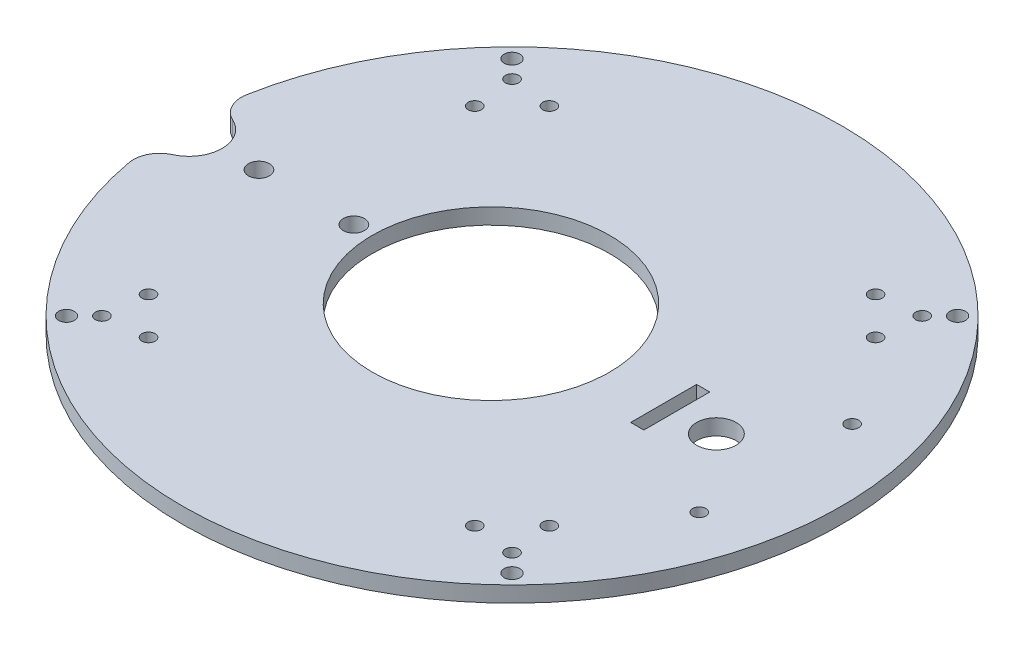
ISO-10303-21;
HEADER;
FILE_DESCRIPTION(('STEP AP214'),'2;1');
FILE_NAME('part.step','',(''),(''),'','','');
FILE_SCHEMA(('AUTOMOTIVE_DESIGN { 1 0 10303 214 1 1 1 1 }'));
ENDSEC;
DATA;
#1=APPLICATION_CONTEXT('core data for automotive mechanical design processes');
#2=APPLICATION_PROTOCOL_DEFINITION('international standard','automotive_design',2000,#1);
#3=PRODUCT_CONTEXT('',#1,'mechanical');
#4=PRODUCT('Part','Part','',(#3));
#5=PRODUCT_RELATED_PRODUCT_CATEGORY('part','',(#4));
#6=PRODUCT_DEFINITION_FORMATION('','',#4);
#7=PRODUCT_DEFINITION_CONTEXT('part definition',#1,'design');
#8=PRODUCT_DEFINITION('design','',#6,#7);
#9=PRODUCT_DEFINITION_SHAPE('','',#8);
#10=(LENGTH_UNIT() NAMED_UNIT(*) SI_UNIT(.MILLI.,.METRE.));
#11=(NAMED_UNIT(*) PLANE_ANGLE_UNIT() SI_UNIT($,.RADIAN.));
#12=(NAMED_UNIT(*) SI_UNIT($,.STERADIAN.) SOLID_ANGLE_UNIT());
#13=UNCERTAINTY_MEASURE_WITH_UNIT(LENGTH_MEASURE(1.E-05),#10,'distance_accuracy_value','');
#14=(GEOMETRIC_REPRESENTATION_CONTEXT(3) GLOBAL_UNCERTAINTY_ASSIGNED_CONTEXT((#13)) GLOBAL_UNIT_ASSIGNED_CONTEXT((#10,
#11,#12)) REPRESENTATION_CONTEXT('',''));
#15=CARTESIAN_POINT('',(0.,0.,0.));
#16=DIRECTION('',(0.,0.,1.));
#17=DIRECTION('',(1.,0.,0.));
#18=AXIS2_PLACEMENT_3D('',#15,#16,#17);
#19=CARTESIAN_POINT('',(0.,6.,0.));
#20=DIRECTION('',(0.,1.,0.));
#21=DIRECTION('',(0.,0.,1.));
#22=AXIS2_PLACEMENT_3D('',#19,#20,#21);
#23=PLANE('',#22);
#24=CARTESIAN_POINT('',(-84.4992603518605,6.,-84.499260351734));
#25=DIRECTION('',(0.,1.,0.));
#26=DIRECTION('',(0.,0.,1.));
#27=AXIS2_PLACEMENT_3D('',#24,#25,#26);
#28=CIRCLE('',#27,3.);
#29=CARTESIAN_POINT('',(-84.4992603518605,6.,-81.499260351734));
#30=VERTEX_POINT('',#29);
#31=EDGE_CURVE('E214',#30,#30,#28,.F.);
#32=ORIENTED_EDGE('',*,*,#31,.T.);
#33=EDGE_LOOP('',(#32));
#34=FACE_BOUND('',#33,.T.);
#35=CARTESIAN_POINT('',(-61.8718433538909,6.,-76.0139789774956));
#36=DIRECTION('',(0.,1.,0.));
#37=DIRECTION('',(0.,0.,1.));
#38=AXIS2_PLACEMENT_3D('',#35,#36,#37);
#39=CIRCLE('',#38,2.49999999999999);
#40=CARTESIAN_POINT('',(-61.8718433538909,6.,-73.5139789774956));
#41=VERTEX_POINT('',#40);
#42=EDGE_CURVE('E211',#41,#41,#39,.F.);
#43=ORIENTED_EDGE('',*,*,#42,.T.);
#44=EDGE_LOOP('',(#43));
#45=FACE_BOUND('',#44,.T.);
#46=CARTESIAN_POINT('',(-76.0139789776217,6.,-61.8718433537646));
#47=DIRECTION('',(0.,1.,0.));
#48=DIRECTION('',(0.,0.,1.));
#49=AXIS2_PLACEMENT_3D('',#46,#47,#48);
#50=CIRCLE('',#49,2.49999999999999);
#51=CARTESIAN_POINT('',(-76.0139789776217,6.,-59.3718433537646));
#52=VERTEX_POINT('',#51);
#53=EDGE_CURVE('E208',#52,#52,#50,.F.);
#54=ORIENTED_EDGE('',*,*,#53,.T.);
#55=EDGE_LOOP('',(#54));
#56=FACE_BOUND('',#55,.T.);
#57=CARTESIAN_POINT('',(-84.4992603517337,6.,84.4992603518608));
#58=DIRECTION('',(0.,1.,0.));
#59=DIRECTION('',(0.,0.,1.));
#60=AXIS2_PLACEMENT_3D('',#57,#58,#59);
#61=CIRCLE('',#60,2.99999999999999);
#62=CARTESIAN_POINT('',(-84.4992603517337,6.,87.4992603518607));
#63=VERTEX_POINT('',#62);
#64=EDGE_CURVE('E205',#63,#63,#61,.F.);
#65=ORIENTED_EDGE('',*,*,#64,.T.);
#66=EDGE_LOOP('',(#65));
#67=FACE_BOUND('',#66,.T.);
#68=CARTESIAN_POINT('',(-76.0139789774954,6.,61.8718433538912));
#69=DIRECTION('',(0.,1.,0.));
#70=DIRECTION('',(0.,0.,1.));
#71=AXIS2_PLACEMENT_3D('',#68,#69,#70);
#72=CIRCLE('',#71,2.5);
#73=CARTESIAN_POINT('',(-76.0139789774954,6.,64.3718433538912));
#74=VERTEX_POINT('',#73);
#75=EDGE_CURVE('E202',#74,#74,#72,.F.);
#76=ORIENTED_EDGE('',*,*,#75,.T.);
#77=EDGE_LOOP('',(#76));
#78=FACE_BOUND('',#77,.T.);
#79=CARTESIAN_POINT('',(-61.8718433537643,6.,76.0139789776219));
#80=DIRECTION('',(0.,1.,0.));
#81=DIRECTION('',(0.,0.,1.));
#82=AXIS2_PLACEMENT_3D('',#79,#80,#81);
#83=CIRCLE('',#82,2.50000000000001);
#84=CARTESIAN_POINT('',(-61.8718433537643,6.,78.513978977622));
#85=VERTEX_POINT('',#84);
#86=EDGE_CURVE('E199',#85,#85,#83,.F.);
#87=ORIENTED_EDGE('',*,*,#86,.T.);
#88=EDGE_LOOP('',(#87));
#89=FACE_BOUND('',#88,.T.);
#90=CARTESIAN_POINT('',(84.4992603518611,6.,84.4992603517334));
#91=DIRECTION('',(0.,1.,0.));
#92=DIRECTION('',(0.,0.,1.));
#93=AXIS2_PLACEMENT_3D('',#90,#91,#92);
#94=CIRCLE('',#93,2.99999999999999);
#95=CARTESIAN_POINT('',(84.4992603518611,6.,87.4992603517334));
#96=VERTEX_POINT('',#95);
#97=EDGE_CURVE('E196',#96,#96,#94,.F.);
#98=ORIENTED_EDGE('',*,*,#97,.T.);
#99=EDGE_LOOP('',(#98));
#100=FACE_BOUND('',#99,.T.);
#101=CARTESIAN_POINT('',(61.8718433538914,6.,76.0139789774952));
#102=DIRECTION('',(0.,1.,0.));
#103=DIRECTION('',(0.,0.,1.));
#104=AXIS2_PLACEMENT_3D('',#101,#102,#103);
#105=CIRCLE('',#104,2.5);
#106=CARTESIAN_POINT('',(61.8718433538914,6.,78.5139789774952));
#107=VERTEX_POINT('',#106);
#108=EDGE_CURVE('E193',#107,#107,#105,.F.);
#109=ORIENTED_EDGE('',*,*,#108,.T.);
#110=EDGE_LOOP('',(#109));
#111=FACE_BOUND('',#110,.T.);
#112=CARTESIAN_POINT('',(61.8718433537648,6.,-76.0139789776215));
#113=DIRECTION('',(0.,1.,0.));
#114=DIRECTION('',(0.,0.,1.));
#115=AXIS2_PLACEMENT_3D('',#112,#113,#114);
#116=CIRCLE('',#115,2.5);
#117=CARTESIAN_POINT('',(61.8718433537648,6.,-73.5139789776215));
#118=VERTEX_POINT('',#117);
#119=EDGE_CURVE('E190',#118,#118,#116,.F.);
#120=ORIENTED_EDGE('',*,*,#119,.T.);
#121=EDGE_LOOP('',(#120));
#122=FACE_BOUND('',#121,.T.);
#123=CARTESIAN_POINT('',(76.0139789774958,6.,-61.8718433538906));
#124=DIRECTION('',(0.,1.,0.));
#125=DIRECTION('',(0.,0.,1.));
#126=AXIS2_PLACEMENT_3D('',#123,#124,#125);
#127=CIRCLE('',#126,2.5);
#128=CARTESIAN_POINT('',(76.0139789774958,6.,-59.3718433538906));
#129=VERTEX_POINT('',#128);
#130=EDGE_CURVE('E187',#129,#129,#127,.F.);
#131=ORIENTED_EDGE('',*,*,#130,.T.);
#132=EDGE_LOOP('',(#131));
#133=FACE_BOUND('',#132,.T.);
#134=CARTESIAN_POINT('',(84.4992603517343,6.,-84.4992603518602));
#135=DIRECTION('',(0.,1.,0.));
#136=DIRECTION('',(0.,0.,1.));
#137=AXIS2_PLACEMENT_3D('',#134,#135,#136);
#138=CIRCLE('',#137,3.);
#139=CARTESIAN_POINT('',(84.4992603517343,6.,-81.4992603518602));
#140=VERTEX_POINT('',#139);
#141=EDGE_CURVE('E184',#140,#140,#138,.F.);
#142=ORIENTED_EDGE('',*,*,#141,.T.);
#143=EDGE_LOOP('',(#142));
#144=FACE_BOUND('',#143,.T.);
#145=CARTESIAN_POINT('',(76.0139789776222,6.,61.871843353764));
#146=DIRECTION('',(0.,1.,0.));
#147=DIRECTION('',(0.,0.,1.));
#148=AXIS2_PLACEMENT_3D('',#145,#146,#147);
#149=CIRCLE('',#148,2.49999999999999);
#150=CARTESIAN_POINT('',(76.0139789776222,6.,64.371843353764));
#151=VERTEX_POINT('',#150);
#152=EDGE_CURVE('E181',#151,#151,#149,.F.);
#153=ORIENTED_EDGE('',*,*,#152,.T.);
#154=EDGE_LOOP('',(#153));
#155=FACE_BOUND('',#154,.T.);
#156=CARTESIAN_POINT('',(77.5,6.,0.));
#157=DIRECTION('',(0.,1.,0.));
#158=DIRECTION('',(0.,0.,1.));
#159=AXIS2_PLACEMENT_3D('',#156,#157,#158);
#160=CIRCLE('',#159,7.5);
#161=CARTESIAN_POINT('',(77.5,6.,7.5));
#162=VERTEX_POINT('',#161);
#163=EDGE_CURVE('E218',#162,#162,#160,.T.);
#164=ORIENTED_EDGE('',*,*,#163,.F.);
#165=EDGE_LOOP('',(#164));
#166=FACE_BOUND('',#165,.T.);
#167=CARTESIAN_POINT('',(100.,6.,-29.));
#168=DIRECTION('',(0.,1.,0.));
#169=DIRECTION('',(0.,0.,1.));
#170=AXIS2_PLACEMENT_3D('',#167,#168,#169);
#171=CIRCLE('',#170,2.50000000000001);
#172=CARTESIAN_POINT('',(100.,6.,-26.5));
#173=VERTEX_POINT('',#172);
#174=EDGE_CURVE('E225',#173,#173,#171,.T.);
#175=ORIENTED_EDGE('',*,*,#174,.F.);
#176=EDGE_LOOP('',(#175));
#177=FACE_BOUND('',#176,.T.);
#178=CARTESIAN_POINT('',(100.,6.,29.));
#179=DIRECTION('',(0.,1.,0.));
#180=DIRECTION('',(0.,0.,-1.));
#181=AXIS2_PLACEMENT_3D('',#178,#179,#180);
#182=CIRCLE('',#181,2.50000000000001);
#183=CARTESIAN_POINT('',(100.,6.,26.5));
#184=VERTEX_POINT('',#183);
#185=EDGE_CURVE('E221',#184,#184,#182,.T.);
#186=ORIENTED_EDGE('',*,*,#185,.F.);
#187=EDGE_LOOP('',(#186));
#188=FACE_BOUND('',#187,.T.);
#189=CARTESIAN_POINT('',(-8.,6.,0.));
#190=DIRECTION('',(0.,1.,0.));
#191=DIRECTION('',(0.,0.,1.));
#192=AXIS2_PLACEMENT_3D('',#189,#190,#191);
#193=CIRCLE('',#192,45.);
#194=CARTESIAN_POINT('',(-8.,6.,45.));
#195=VERTEX_POINT('',#194);
#196=EDGE_CURVE('E239',#195,#195,#193,.F.);
#197=ORIENTED_EDGE('',*,*,#196,.T.);
#198=EDGE_LOOP('',(#197));
#199=FACE_BOUND('',#198,.T.);
#200=CARTESIAN_POINT('',(-77.7817459305157,6.,77.7817459305204));
#201=DIRECTION('',(0.,1.,0.));
#202=DIRECTION('',(0.,0.,1.));
#203=AXIS2_PLACEMENT_3D('',#200,#201,#202);
#204=CIRCLE('',#203,2.50000000000501);
#205=CARTESIAN_POINT('',(-77.7817459305157,6.,80.2817459305254));
#206=VERTEX_POINT('',#205);
#207=EDGE_CURVE('E242',#206,#206,#204,.T.);
#208=ORIENTED_EDGE('',*,*,#207,.F.);
#209=EDGE_LOOP('',(#208));
#210=FACE_BOUND('',#209,.T.);
#211=CARTESIAN_POINT('',(77.7817459305248,6.,77.7817459305157));
#212=DIRECTION('',(0.,1.,0.));
#213=DIRECTION('',(0.,0.,1.));
#214=AXIS2_PLACEMENT_3D('',#211,#212,#213);
#215=CIRCLE('',#214,2.50000000000671);
#216=CARTESIAN_POINT('',(77.7817459305248,6.,80.2817459305224));
#217=VERTEX_POINT('',#216);
#218=EDGE_CURVE('E253',#217,#217,#215,.T.);
#219=ORIENTED_EDGE('',*,*,#218,.F.);
#220=EDGE_LOOP('',(#219));
#221=FACE_BOUND('',#220,.T.);
#222=CARTESIAN_POINT('',(77.7817459305201,6.,-77.7817459305247));
#223=DIRECTION('',(0.,1.,0.));
#224=DIRECTION('',(0.,0.,1.));
#225=AXIS2_PLACEMENT_3D('',#222,#223,#224);
#226=CIRCLE('',#225,2.50000000000242);
#227=CARTESIAN_POINT('',(77.7817459305201,6.,-75.2817459305223));
#228=VERTEX_POINT('',#227);
#229=EDGE_CURVE('E247',#228,#228,#226,.T.);
#230=ORIENTED_EDGE('',*,*,#229,.F.);
#231=EDGE_LOOP('',(#230));
#232=FACE_BOUND('',#231,.T.);
#233=CARTESIAN_POINT('',(-77.7817459305204,6.,-77.7817459305201));
#234=DIRECTION('',(0.,1.,0.));
#235=DIRECTION('',(0.,0.,1.));
#236=AXIS2_PLACEMENT_3D('',#233,#234,#235);
#237=CIRCLE('',#236,2.5);
#238=CARTESIAN_POINT('',(-77.7817459305204,6.,-75.2817459305201));
#239=VERTEX_POINT('',#238);
#240=EDGE_CURVE('E261',#239,#239,#237,.T.);
#241=ORIENTED_EDGE('',*,*,#240,.F.);
#242=EDGE_LOOP('',(#241));
#243=FACE_BOUND('',#242,.T.);
#244=CARTESIAN_POINT('',(-96.,6.,0.));
#245=DIRECTION('',(0.,1.,0.));
#246=DIRECTION('',(0.,0.,1.));
#247=AXIS2_PLACEMENT_3D('',#244,#245,#246);
#248=CIRCLE('',#247,4.00000000000001);
#249=CARTESIAN_POINT('',(-96.,6.,4.00000000000001));
#250=VERTEX_POINT('',#249);
#251=EDGE_CURVE('E273',#250,#250,#248,.T.);
#252=ORIENTED_EDGE('',*,*,#251,.F.);
#253=EDGE_LOOP('',(#252));
#254=FACE_BOUND('',#253,.T.);
#255=CARTESIAN_POINT('',(-60.,6.,0.));
#256=DIRECTION('',(0.,1.,0.));
#257=DIRECTION('',(0.,0.,1.));
#258=AXIS2_PLACEMENT_3D('',#255,#256,#257);
#259=CIRCLE('',#258,4.00000000000001);
#260=CARTESIAN_POINT('',(-60.,6.,4.00000000000001));
#261=VERTEX_POINT('',#260);
#262=EDGE_CURVE('E267',#261,#261,#259,.T.);
#263=ORIENTED_EDGE('',*,*,#262,.F.);
#264=EDGE_LOOP('',(#263));
#265=FACE_BOUND('',#264,.T.);
#266=CARTESIAN_POINT('',(-122.5,6.,0.));
#267=DIRECTION('',(0.,1.,0.));
#268=DIRECTION('',(0.,0.,1.));
#269=AXIS2_PLACEMENT_3D('',#266,#267,#268);
#270=CIRCLE('',#269,12.5);
#271=CARTESIAN_POINT('',(-110.,6.,0.));
#272=VERTEX_POINT('',#271);
#273=CARTESIAN_POINT('',(-117.312925170068,6.,11.3729615627894));
#274=VERTEX_POINT('',#273);
#275=EDGE_CURVE('E286',#272,#274,#270,.F.);
#276=ORIENTED_EDGE('',*,*,#275,.T.);
#277=CARTESIAN_POINT('',(-113.163265306122,6.,20.471330813021));
#278=DIRECTION('',(0.,1.,0.));
#279=DIRECTION('',(0.,0.,1.));
#280=AXIS2_PLACEMENT_3D('',#277,#278,#279);
#281=CIRCLE('',#280,10.);
#282=CARTESIAN_POINT('',(-123.003549245785,6.,22.2514465358924));
#283=VERTEX_POINT('',#282);
#284=EDGE_CURVE('E301',#274,#283,#281,.T.);
#285=ORIENTED_EDGE('',*,*,#284,.T.);
#286=CARTESIAN_POINT('',(0.,6.,0.));
#287=DIRECTION('',(0.,1.,0.));
#288=DIRECTION('',(0.,0.,1.));
#289=AXIS2_PLACEMENT_3D('',#286,#287,#288);
#290=CIRCLE('',#289,125.);
#291=CARTESIAN_POINT('',(-123.003549245785,6.,-22.2514465358924));
#292=VERTEX_POINT('',#291);
#293=EDGE_CURVE('E279',#283,#292,#290,.T.);
#294=ORIENTED_EDGE('',*,*,#293,.T.);
#295=CARTESIAN_POINT('',(-113.163265306122,6.,-20.471330813021));
#296=DIRECTION('',(0.,1.,0.));
#297=DIRECTION('',(0.,0.,1.));
#298=AXIS2_PLACEMENT_3D('',#295,#296,#297);
#299=CIRCLE('',#298,10.);
#300=CARTESIAN_POINT('',(-117.312925170068,6.,-11.3729615627894));
#301=VERTEX_POINT('',#300);
#302=EDGE_CURVE('E299',#292,#301,#299,.T.);
#303=ORIENTED_EDGE('',*,*,#302,.T.);
#304=CARTESIAN_POINT('',(-122.5,6.,0.));
#305=DIRECTION('',(0.,1.,0.));
#306=DIRECTION('',(0.,0.,1.));
#307=AXIS2_PLACEMENT_3D('',#304,#305,#306);
#308=CIRCLE('',#307,12.5);
#309=EDGE_CURVE('E292',#301,#272,#308,.F.);
#310=ORIENTED_EDGE('',*,*,#309,.T.);
#311=EDGE_LOOP('',(#276,#285,#294,#303,#310));
#312=FACE_BOUND('',#311,.T.);
#313=DIRECTION('',(1.,0.,0.));
#314=VECTOR('',#313,1.);
#315=CARTESIAN_POINT('',(62.5,6.,12.5));
#316=LINE('',#315,#314);
#317=CARTESIAN_POINT('',(57.5,6.,12.5));
#318=VERTEX_POINT('',#317);
#319=CARTESIAN_POINT('',(62.5,6.,12.5));
#320=VERTEX_POINT('',#319);
#321=EDGE_CURVE('E118',#318,#320,#316,.T.);
#322=ORIENTED_EDGE('',*,*,#321,.F.);
#323=DIRECTION('',(0.,0.,1.));
#324=VECTOR('',#323,1.);
#325=CARTESIAN_POINT('',(57.5,6.,-12.5));
#326=LINE('',#325,#324);
#327=CARTESIAN_POINT('',(57.5,6.,-12.5));
#328=VERTEX_POINT('',#327);
#329=EDGE_CURVE('E110',#328,#318,#326,.T.);
#330=ORIENTED_EDGE('',*,*,#329,.F.);
#331=DIRECTION('',(-1.,0.,0.));
#332=VECTOR('',#331,1.);
#333=CARTESIAN_POINT('',(62.5,6.,-12.5));
#334=LINE('',#333,#332);
#335=CARTESIAN_POINT('',(62.5,6.,-12.5));
#336=VERTEX_POINT('',#335);
#337=EDGE_CURVE('E132',#336,#328,#334,.T.);
#338=ORIENTED_EDGE('',*,*,#337,.F.);
#339=DIRECTION('',(0.,0.,-1.));
#340=VECTOR('',#339,1.);
#341=CARTESIAN_POINT('',(62.5,6.,-12.5));
#342=LINE('',#341,#340);
#343=EDGE_CURVE('E130',#320,#336,#342,.T.);
#344=ORIENTED_EDGE('',*,*,#343,.F.);
#345=EDGE_LOOP('',(#322,#330,#338,#344));
#346=FACE_BOUND('',#345,.T.);
#347=ADVANCED_FACE('F39',(#34,#45,#56,#67,#78,#89,#100,#111,#122,#133,#144,#155,#166,#177,#188,
#199,#210,#221,#232,#243,#254,#265,#312,#346),#23,.T.);
#348=CARTESIAN_POINT('',(0.,0.,0.));
#349=DIRECTION('',(0.,1.,0.));
#350=DIRECTION('',(0.,0.,1.));
#351=AXIS2_PLACEMENT_3D('',#348,#349,#350);
#352=PLANE('',#351);
#353=CARTESIAN_POINT('',(0.,0.,0.));
#354=DIRECTION('',(0.,1.,0.));
#355=DIRECTION('',(0.,0.,1.));
#356=AXIS2_PLACEMENT_3D('',#353,#354,#355);
#357=CIRCLE('',#356,125.);
#358=CARTESIAN_POINT('',(-123.003549245785,0.,22.2514465358924));
#359=VERTEX_POINT('',#358);
#360=CARTESIAN_POINT('',(-123.003549245785,0.,-22.2514465358924));
#361=VERTEX_POINT('',#360);
#362=EDGE_CURVE('E276',#359,#361,#357,.T.);
#363=ORIENTED_EDGE('',*,*,#362,.F.);
#364=CARTESIAN_POINT('',(-113.163265306122,0.,20.471330813021));
#365=DIRECTION('',(0.,1.,0.));
#366=DIRECTION('',(0.,0.,1.));
#367=AXIS2_PLACEMENT_3D('',#364,#365,#366);
#368=CIRCLE('',#367,10.);
#369=CARTESIAN_POINT('',(-117.312925170068,0.,11.3729615627894));
#370=VERTEX_POINT('',#369);
#371=EDGE_CURVE('E47',#359,#370,#368,.F.);
#372=ORIENTED_EDGE('',*,*,#371,.T.);
#373=CARTESIAN_POINT('',(-122.5,0.,0.));
#374=DIRECTION('',(0.,1.,0.));
#375=DIRECTION('',(0.,0.,1.));
#376=AXIS2_PLACEMENT_3D('',#373,#374,#375);
#377=CIRCLE('',#376,12.5);
#378=CARTESIAN_POINT('',(-110.,0.,0.));
#379=VERTEX_POINT('',#378);
#380=EDGE_CURVE('E282',#370,#379,#377,.T.);
#381=ORIENTED_EDGE('',*,*,#380,.T.);
#382=CARTESIAN_POINT('',(-122.5,0.,0.));
#383=DIRECTION('',(0.,1.,0.));
#384=DIRECTION('',(0.,0.,1.));
#385=AXIS2_PLACEMENT_3D('',#382,#383,#384);
#386=CIRCLE('',#385,12.5);
#387=CARTESIAN_POINT('',(-117.312925170068,0.,-11.3729615627894));
#388=VERTEX_POINT('',#387);
#389=EDGE_CURVE('E289',#379,#388,#386,.T.);
#390=ORIENTED_EDGE('',*,*,#389,.T.);
#391=CARTESIAN_POINT('',(-113.163265306122,0.,-20.471330813021));
#392=DIRECTION('',(0.,1.,0.));
#393=DIRECTION('',(0.,0.,1.));
#394=AXIS2_PLACEMENT_3D('',#391,#392,#393);
#395=CIRCLE('',#394,10.);
#396=EDGE_CURVE('E307',#388,#361,#395,.F.);
#397=ORIENTED_EDGE('',*,*,#396,.T.);
#398=EDGE_LOOP('',(#363,#372,#381,#390,#397));
#399=FACE_BOUND('',#398,.T.);
#400=CARTESIAN_POINT('',(77.5,0.,0.));
#401=DIRECTION('',(0.,1.,0.));
#402=DIRECTION('',(0.,0.,1.));
#403=AXIS2_PLACEMENT_3D('',#400,#401,#402);
#404=CIRCLE('',#403,7.5);
#405=CARTESIAN_POINT('',(77.5,0.,7.5));
#406=VERTEX_POINT('',#405);
#407=EDGE_CURVE('E222',#406,#406,#404,.T.);
#408=ORIENTED_EDGE('',*,*,#407,.T.);
#409=EDGE_LOOP('',(#408));
#410=FACE_BOUND('',#409,.T.);
#411=CARTESIAN_POINT('',(100.,0.,-29.));
#412=DIRECTION('',(0.,1.,0.));
#413=DIRECTION('',(0.,0.,1.));
#414=AXIS2_PLACEMENT_3D('',#411,#412,#413);
#415=CIRCLE('',#414,2.50000000000001);
#416=CARTESIAN_POINT('',(100.,0.,-26.5));
#417=VERTEX_POINT('',#416);
#418=EDGE_CURVE('E229',#417,#417,#415,.T.);
#419=ORIENTED_EDGE('',*,*,#418,.T.);
#420=EDGE_LOOP('',(#419));
#421=FACE_BOUND('',#420,.T.);
#422=CARTESIAN_POINT('',(100.,0.,29.));
#423=DIRECTION('',(0.,1.,0.));
#424=DIRECTION('',(0.,0.,-1.));
#425=AXIS2_PLACEMENT_3D('',#422,#423,#424);
#426=CIRCLE('',#425,2.50000000000001);
#427=CARTESIAN_POINT('',(100.,0.,26.5));
#428=VERTEX_POINT('',#427);
#429=EDGE_CURVE('E232',#428,#428,#426,.T.);
#430=ORIENTED_EDGE('',*,*,#429,.T.);
#431=EDGE_LOOP('',(#430));
#432=FACE_BOUND('',#431,.T.);
#433=CARTESIAN_POINT('',(-8.,0.,0.));
#434=DIRECTION('',(0.,1.,0.));
#435=DIRECTION('',(0.,0.,1.));
#436=AXIS2_PLACEMENT_3D('',#433,#434,#435);
#437=CIRCLE('',#436,45.);
#438=CARTESIAN_POINT('',(-8.,0.,45.));
#439=VERTEX_POINT('',#438);
#440=EDGE_CURVE('E228',#439,#439,#437,.T.);
#441=ORIENTED_EDGE('',*,*,#440,.T.);
#442=EDGE_LOOP('',(#441));
#443=FACE_BOUND('',#442,.T.);
#444=CARTESIAN_POINT('',(-77.7817459305157,0.,77.7817459305204));
#445=DIRECTION('',(0.,1.,0.));
#446=DIRECTION('',(0.,0.,1.));
#447=AXIS2_PLACEMENT_3D('',#444,#445,#446);
#448=CIRCLE('',#447,2.50000000000501);
#449=CARTESIAN_POINT('',(-77.7817459305157,0.,80.2817459305254));
#450=VERTEX_POINT('',#449);
#451=EDGE_CURVE('E256',#450,#450,#448,.T.);
#452=ORIENTED_EDGE('',*,*,#451,.T.);
#453=EDGE_LOOP('',(#452));
#454=FACE_BOUND('',#453,.T.);
#455=CARTESIAN_POINT('',(77.7817459305248,0.,77.7817459305157));
#456=DIRECTION('',(0.,1.,0.));
#457=DIRECTION('',(0.,0.,1.));
#458=AXIS2_PLACEMENT_3D('',#455,#456,#457);
#459=CIRCLE('',#458,2.50000000000671);
#460=CARTESIAN_POINT('',(77.7817459305248,0.,80.2817459305224));
#461=VERTEX_POINT('',#460);
#462=EDGE_CURVE('E250',#461,#461,#459,.T.);
#463=ORIENTED_EDGE('',*,*,#462,.T.);
#464=EDGE_LOOP('',(#463));
#465=FACE_BOUND('',#464,.T.);
#466=CARTESIAN_POINT('',(77.7817459305201,0.,-77.7817459305247));
#467=DIRECTION('',(0.,1.,0.));
#468=DIRECTION('',(0.,0.,1.));
#469=AXIS2_PLACEMENT_3D('',#466,#467,#468);
#470=CIRCLE('',#469,2.50000000000242);
#471=CARTESIAN_POINT('',(77.7817459305201,0.,-75.2817459305223));
#472=VERTEX_POINT('',#471);
#473=EDGE_CURVE('E243',#472,#472,#470,.T.);
#474=ORIENTED_EDGE('',*,*,#473,.T.);
#475=EDGE_LOOP('',(#474));
#476=FACE_BOUND('',#475,.T.);
#477=CARTESIAN_POINT('',(-77.7817459305204,0.,-77.7817459305201));
#478=DIRECTION('',(0.,1.,0.));
#479=DIRECTION('',(0.,0.,1.));
#480=AXIS2_PLACEMENT_3D('',#477,#478,#479);
#481=CIRCLE('',#480,2.5);
#482=CARTESIAN_POINT('',(-77.7817459305204,0.,-75.2817459305201));
#483=VERTEX_POINT('',#482);
#484=EDGE_CURVE('E246',#483,#483,#481,.T.);
#485=ORIENTED_EDGE('',*,*,#484,.T.);
#486=EDGE_LOOP('',(#485));
#487=FACE_BOUND('',#486,.T.);
#488=CARTESIAN_POINT('',(-96.,0.,0.));
#489=DIRECTION('',(0.,1.,0.));
#490=DIRECTION('',(0.,0.,1.));
#491=AXIS2_PLACEMENT_3D('',#488,#489,#490);
#492=CIRCLE('',#491,4.00000000000001);
#493=CARTESIAN_POINT('',(-96.,0.,4.00000000000001));
#494=VERTEX_POINT('',#493);
#495=EDGE_CURVE('E270',#494,#494,#492,.T.);
#496=ORIENTED_EDGE('',*,*,#495,.T.);
#497=EDGE_LOOP('',(#496));
#498=FACE_BOUND('',#497,.T.);
#499=CARTESIAN_POINT('',(-60.,0.,0.));
#500=DIRECTION('',(0.,1.,0.));
#501=DIRECTION('',(0.,0.,1.));
#502=AXIS2_PLACEMENT_3D('',#499,#500,#501);
#503=CIRCLE('',#502,4.00000000000001);
#504=CARTESIAN_POINT('',(-60.,0.,4.00000000000001));
#505=VERTEX_POINT('',#504);
#506=EDGE_CURVE('E264',#505,#505,#503,.T.);
#507=ORIENTED_EDGE('',*,*,#506,.T.);
#508=EDGE_LOOP('',(#507));
#509=FACE_BOUND('',#508,.T.);
#510=CARTESIAN_POINT('',(76.0139789776222,0.,61.871843353764));
#511=DIRECTION('',(0.,1.,0.));
#512=DIRECTION('',(0.,0.,1.));
#513=AXIS2_PLACEMENT_3D('',#510,#511,#512);
#514=CIRCLE('',#513,2.49999999999999);
#515=CARTESIAN_POINT('',(76.0139789776222,0.,64.371843353764));
#516=VERTEX_POINT('',#515);
#517=EDGE_CURVE('E170',#516,#516,#514,.T.);
#518=ORIENTED_EDGE('',*,*,#517,.T.);
#519=EDGE_LOOP('',(#518));
#520=FACE_BOUND('',#519,.T.);
#521=CARTESIAN_POINT('',(84.4992603517343,0.,-84.4992603518602));
#522=DIRECTION('',(0.,1.,0.));
#523=DIRECTION('',(0.,0.,1.));
#524=AXIS2_PLACEMENT_3D('',#521,#522,#523);
#525=CIRCLE('',#524,3.);
#526=CARTESIAN_POINT('',(84.4992603517343,0.,-81.4992603518602));
#527=VERTEX_POINT('',#526);
#528=EDGE_CURVE('E126',#527,#527,#525,.T.);
#529=ORIENTED_EDGE('',*,*,#528,.T.);
#530=EDGE_LOOP('',(#529));
#531=FACE_BOUND('',#530,.T.);
#532=CARTESIAN_POINT('',(76.0139789774958,0.,-61.8718433538906));
#533=DIRECTION('',(0.,1.,0.));
#534=DIRECTION('',(0.,0.,1.));
#535=AXIS2_PLACEMENT_3D('',#532,#533,#534);
#536=CIRCLE('',#535,2.5);
#537=CARTESIAN_POINT('',(76.0139789774958,0.,-59.3718433538906));
#538=VERTEX_POINT('',#537);
#539=EDGE_CURVE('E150',#538,#538,#536,.T.);
#540=ORIENTED_EDGE('',*,*,#539,.T.);
#541=EDGE_LOOP('',(#540));
#542=FACE_BOUND('',#541,.T.);
#543=CARTESIAN_POINT('',(61.8718433537648,0.,-76.0139789776215));
#544=DIRECTION('',(0.,1.,0.));
#545=DIRECTION('',(0.,0.,1.));
#546=AXIS2_PLACEMENT_3D('',#543,#544,#545);
#547=CIRCLE('',#546,2.5);
#548=CARTESIAN_POINT('',(61.8718433537648,0.,-73.5139789776215));
#549=VERTEX_POINT('',#548);
#550=EDGE_CURVE('E146',#549,#549,#547,.T.);
#551=ORIENTED_EDGE('',*,*,#550,.T.);
#552=EDGE_LOOP('',(#551));
#553=FACE_BOUND('',#552,.T.);
#554=CARTESIAN_POINT('',(61.8718433538914,0.,76.0139789774952));
#555=DIRECTION('',(0.,1.,0.));
#556=DIRECTION('',(0.,0.,1.));
#557=AXIS2_PLACEMENT_3D('',#554,#555,#556);
#558=CIRCLE('',#557,2.5);
#559=CARTESIAN_POINT('',(61.8718433538914,0.,78.5139789774952));
#560=VERTEX_POINT('',#559);
#561=EDGE_CURVE('E167',#560,#560,#558,.T.);
#562=ORIENTED_EDGE('',*,*,#561,.T.);
#563=EDGE_LOOP('',(#562));
#564=FACE_BOUND('',#563,.T.);
#565=CARTESIAN_POINT('',(84.4992603518611,0.,84.4992603517334));
#566=DIRECTION('',(0.,1.,0.));
#567=DIRECTION('',(0.,0.,1.));
#568=AXIS2_PLACEMENT_3D('',#565,#566,#567);
#569=CIRCLE('',#568,2.99999999999999);
#570=CARTESIAN_POINT('',(84.4992603518611,0.,87.4992603517334));
#571=VERTEX_POINT('',#570);
#572=EDGE_CURVE('E171',#571,#571,#569,.T.);
#573=ORIENTED_EDGE('',*,*,#572,.T.);
#574=EDGE_LOOP('',(#573));
#575=FACE_BOUND('',#574,.T.);
#576=CARTESIAN_POINT('',(-61.8718433537643,0.,76.0139789776219));
#577=DIRECTION('',(0.,1.,0.));
#578=DIRECTION('',(0.,0.,1.));
#579=AXIS2_PLACEMENT_3D('',#576,#577,#578);
#580=CIRCLE('',#579,2.50000000000001);
#581=CARTESIAN_POINT('',(-61.8718433537643,0.,78.513978977622));
#582=VERTEX_POINT('',#581);
#583=EDGE_CURVE('E174',#582,#582,#580,.T.);
#584=ORIENTED_EDGE('',*,*,#583,.T.);
#585=EDGE_LOOP('',(#584));
#586=FACE_BOUND('',#585,.T.);
#587=CARTESIAN_POINT('',(-76.0139789774954,0.,61.8718433538912));
#588=DIRECTION('',(0.,1.,0.));
#589=DIRECTION('',(0.,0.,1.));
#590=AXIS2_PLACEMENT_3D('',#587,#588,#589);
#591=CIRCLE('',#590,2.5);
#592=CARTESIAN_POINT('',(-76.0139789774954,0.,64.3718433538912));
#593=VERTEX_POINT('',#592);
#594=EDGE_CURVE('E158',#593,#593,#591,.T.);
#595=ORIENTED_EDGE('',*,*,#594,.T.);
#596=EDGE_LOOP('',(#595));
#597=FACE_BOUND('',#596,.T.);
#598=CARTESIAN_POINT('',(-84.4992603517337,0.,84.4992603518608));
#599=DIRECTION('',(0.,1.,0.));
#600=DIRECTION('',(0.,0.,1.));
#601=AXIS2_PLACEMENT_3D('',#598,#599,#600);
#602=CIRCLE('',#601,2.99999999999999);
#603=CARTESIAN_POINT('',(-84.4992603517337,0.,87.4992603518607));
#604=VERTEX_POINT('',#603);
#605=EDGE_CURVE('E155',#604,#604,#602,.T.);
#606=ORIENTED_EDGE('',*,*,#605,.T.);
#607=EDGE_LOOP('',(#606));
#608=FACE_BOUND('',#607,.T.);
#609=CARTESIAN_POINT('',(-76.0139789776217,0.,-61.8718433537646));
#610=DIRECTION('',(0.,1.,0.));
#611=DIRECTION('',(0.,0.,1.));
#612=AXIS2_PLACEMENT_3D('',#609,#610,#611);
#613=CIRCLE('',#612,2.49999999999999);
#614=CARTESIAN_POINT('',(-76.0139789776217,0.,-59.3718433537646));
#615=VERTEX_POINT('',#614);
#616=EDGE_CURVE('E159',#615,#615,#613,.T.);
#617=ORIENTED_EDGE('',*,*,#616,.T.);
#618=EDGE_LOOP('',(#617));
#619=FACE_BOUND('',#618,.T.);
#620=CARTESIAN_POINT('',(-61.8718433538909,0.,-76.0139789774956));
#621=DIRECTION('',(0.,1.,0.));
#622=DIRECTION('',(0.,0.,1.));
#623=AXIS2_PLACEMENT_3D('',#620,#621,#622);
#624=CIRCLE('',#623,2.49999999999999);
#625=CARTESIAN_POINT('',(-61.8718433538909,0.,-73.5139789774956));
#626=VERTEX_POINT('',#625);
#627=EDGE_CURVE('E162',#626,#626,#624,.T.);
#628=ORIENTED_EDGE('',*,*,#627,.T.);
#629=EDGE_LOOP('',(#628));
#630=FACE_BOUND('',#629,.T.);
#631=CARTESIAN_POINT('',(-84.4992603518605,0.,-84.499260351734));
#632=DIRECTION('',(0.,1.,0.));
#633=DIRECTION('',(0.,0.,1.));
#634=AXIS2_PLACEMENT_3D('',#631,#632,#633);
#635=CIRCLE('',#634,3.);
#636=CARTESIAN_POINT('',(-84.4992603518605,0.,-81.499260351734));
#637=VERTEX_POINT('',#636);
#638=EDGE_CURVE('E149',#637,#637,#635,.T.);
#639=ORIENTED_EDGE('',*,*,#638,.T.);
#640=EDGE_LOOP('',(#639));
#641=FACE_BOUND('',#640,.T.);
#642=DIRECTION('',(0.,0.,1.));
#643=VECTOR('',#642,1.);
#644=CARTESIAN_POINT('',(57.5,0.,-12.5));
#645=LINE('',#644,#643);
#646=CARTESIAN_POINT('',(57.5,0.,-12.5));
#647=VERTEX_POINT('',#646);
#648=CARTESIAN_POINT('',(57.5,0.,12.5));
#649=VERTEX_POINT('',#648);
#650=EDGE_CURVE('E62',#647,#649,#645,.T.);
#651=ORIENTED_EDGE('',*,*,#650,.T.);
#652=DIRECTION('',(1.,0.,0.));
#653=VECTOR('',#652,1.);
#654=CARTESIAN_POINT('',(62.5,0.,12.5));
#655=LINE('',#654,#653);
#656=CARTESIAN_POINT('',(62.5,0.,12.5));
#657=VERTEX_POINT('',#656);
#658=EDGE_CURVE('E125',#649,#657,#655,.T.);
#659=ORIENTED_EDGE('',*,*,#658,.T.);
#660=DIRECTION('',(0.,0.,-1.));
#661=VECTOR('',#660,1.);
#662=CARTESIAN_POINT('',(62.5,0.,-12.5));
#663=LINE('',#662,#661);
#664=CARTESIAN_POINT('',(62.5,0.,-12.5));
#665=VERTEX_POINT('',#664);
#666=EDGE_CURVE('E138',#657,#665,#663,.T.);
#667=ORIENTED_EDGE('',*,*,#666,.T.);
#668=DIRECTION('',(-1.,0.,0.));
#669=VECTOR('',#668,1.);
#670=CARTESIAN_POINT('',(62.5,0.,-12.5));
#671=LINE('',#670,#669);
#672=EDGE_CURVE('E119',#665,#647,#671,.T.);
#673=ORIENTED_EDGE('',*,*,#672,.T.);
#674=EDGE_LOOP('',(#651,#659,#667,#673));
#675=FACE_BOUND('',#674,.T.);
#676=ADVANCED_FACE('F312',(#399,#410,#421,#432,#443,#454,#465,#476,#487,#498,#509,#520,#531,
#542,#553,#564,#575,#586,#597,#608,#619,#630,#641,#675),#352,.F.);
#677=CARTESIAN_POINT('',(0.,6.,0.));
#678=DIRECTION('',(0.,-1.,0.));
#679=DIRECTION('',(0.,0.,-1.));
#680=AXIS2_PLACEMENT_3D('',#677,#678,#679);
#681=CYLINDRICAL_SURFACE('',#680,125.);
#682=ORIENTED_EDGE('',*,*,#293,.F.);
#683=DIRECTION('',(0.,-1.,0.));
#684=VECTOR('',#683,1.);
#685=CARTESIAN_POINT('',(-123.003549245785,6.,22.2514465358924));
#686=LINE('',#685,#684);
#687=EDGE_CURVE('E305',#283,#359,#686,.T.);
#688=ORIENTED_EDGE('',*,*,#687,.T.);
#689=ORIENTED_EDGE('',*,*,#362,.T.);
#690=DIRECTION('',(0.,-1.,0.));
#691=VECTOR('',#690,1.);
#692=CARTESIAN_POINT('',(-123.003549245785,6.,-22.2514465358924));
#693=LINE('',#692,#691);
#694=EDGE_CURVE('E303',#361,#292,#693,.F.);
#695=ORIENTED_EDGE('',*,*,#694,.T.);
#696=EDGE_LOOP('',(#682,#688,#689,#695));
#697=FACE_BOUND('',#696,.T.);
#698=ADVANCED_FACE('F327',(#697),#681,.T.);
#699=CARTESIAN_POINT('',(-96.,6.,0.));
#700=DIRECTION('',(0.,-1.,0.));
#701=DIRECTION('',(0.,0.,-1.));
#702=AXIS2_PLACEMENT_3D('',#699,#700,#701);
#703=CYLINDRICAL_SURFACE('',#702,4.00000000000001);
#704=ORIENTED_EDGE('',*,*,#251,.T.);
#705=EDGE_LOOP('',(#704));
#706=FACE_BOUND('',#705,.T.);
#707=ORIENTED_EDGE('',*,*,#495,.F.);
#708=EDGE_LOOP('',(#707));
#709=FACE_BOUND('',#708,.T.);
#710=ADVANCED_FACE('F354',(#706,#709),#703,.F.);
#711=CARTESIAN_POINT('',(-60.,6.,0.));
#712=DIRECTION('',(0.,-1.,0.));
#713=DIRECTION('',(0.,0.,-1.));
#714=AXIS2_PLACEMENT_3D('',#711,#712,#713);
#715=CYLINDRICAL_SURFACE('',#714,4.00000000000001);
#716=ORIENTED_EDGE('',*,*,#262,.T.);
#717=EDGE_LOOP('',(#716));
#718=FACE_BOUND('',#717,.T.);
#719=ORIENTED_EDGE('',*,*,#506,.F.);
#720=EDGE_LOOP('',(#719));
#721=FACE_BOUND('',#720,.T.);
#722=ADVANCED_FACE('F361',(#718,#721),#715,.F.);
#723=CARTESIAN_POINT('',(-77.7817459305204,6.,-77.7817459305201));
#724=DIRECTION('',(0.,-1.,0.));
#725=DIRECTION('',(0.,0.,-1.));
#726=AXIS2_PLACEMENT_3D('',#723,#724,#725);
#727=CYLINDRICAL_SURFACE('',#726,2.5);
#728=ORIENTED_EDGE('',*,*,#240,.T.);
#729=EDGE_LOOP('',(#728));
#730=FACE_BOUND('',#729,.T.);
#731=ORIENTED_EDGE('',*,*,#484,.F.);
#732=EDGE_LOOP('',(#731));
#733=FACE_BOUND('',#732,.T.);
#734=ADVANCED_FACE('F366',(#730,#733),#727,.F.);
#735=CARTESIAN_POINT('',(77.7817459305201,6.,-77.7817459305247));
#736=DIRECTION('',(0.,-1.,0.));
#737=DIRECTION('',(0.,0.,-1.));
#738=AXIS2_PLACEMENT_3D('',#735,#736,#737);
#739=CYLINDRICAL_SURFACE('',#738,2.50000000000242);
#740=ORIENTED_EDGE('',*,*,#229,.T.);
#741=EDGE_LOOP('',(#740));
#742=FACE_BOUND('',#741,.T.);
#743=ORIENTED_EDGE('',*,*,#473,.F.);
#744=EDGE_LOOP('',(#743));
#745=FACE_BOUND('',#744,.T.);
#746=ADVANCED_FACE('F474',(#742,#745),#739,.F.);
#747=CARTESIAN_POINT('',(77.7817459305248,6.,77.7817459305157));
#748=DIRECTION('',(0.,-1.,0.));
#749=DIRECTION('',(0.,0.,-1.));
#750=AXIS2_PLACEMENT_3D('',#747,#748,#749);
#751=CYLINDRICAL_SURFACE('',#750,2.50000000000671);
#752=ORIENTED_EDGE('',*,*,#218,.T.);
#753=EDGE_LOOP('',(#752));
#754=FACE_BOUND('',#753,.T.);
#755=ORIENTED_EDGE('',*,*,#462,.F.);
#756=EDGE_LOOP('',(#755));
#757=FACE_BOUND('',#756,.T.);
#758=ADVANCED_FACE('F477',(#754,#757),#751,.F.);
#759=CARTESIAN_POINT('',(-77.7817459305157,6.,77.7817459305204));
#760=DIRECTION('',(0.,-1.,0.));
#761=DIRECTION('',(0.,0.,-1.));
#762=AXIS2_PLACEMENT_3D('',#759,#760,#761);
#763=CYLINDRICAL_SURFACE('',#762,2.50000000000501);
#764=ORIENTED_EDGE('',*,*,#207,.T.);
#765=EDGE_LOOP('',(#764));
#766=FACE_BOUND('',#765,.T.);
#767=ORIENTED_EDGE('',*,*,#451,.F.);
#768=EDGE_LOOP('',(#767));
#769=FACE_BOUND('',#768,.T.);
#770=ADVANCED_FACE('F472',(#766,#769),#763,.F.);
#771=CARTESIAN_POINT('',(-8.,10.,0.));
#772=DIRECTION('',(0.,-1.,0.));
#773=DIRECTION('',(0.,0.,-1.));
#774=AXIS2_PLACEMENT_3D('',#771,#772,#773);
#775=CYLINDRICAL_SURFACE('',#774,45.);
#776=ORIENTED_EDGE('',*,*,#196,.F.);
#777=EDGE_LOOP('',(#776));
#778=FACE_BOUND('',#777,.T.);
#779=ORIENTED_EDGE('',*,*,#440,.F.);
#780=EDGE_LOOP('',(#779));
#781=FACE_BOUND('',#780,.T.);
#782=ADVANCED_FACE('F468',(#778,#781),#775,.F.);
#783=CARTESIAN_POINT('',(100.,6.,29.));
#784=DIRECTION('',(0.,-1.,0.));
#785=DIRECTION('',(0.,0.,-1.));
#786=AXIS2_PLACEMENT_3D('',#783,#784,#785);
#787=CYLINDRICAL_SURFACE('',#786,2.50000000000001);
#788=ORIENTED_EDGE('',*,*,#185,.T.);
#789=EDGE_LOOP('',(#788));
#790=FACE_BOUND('',#789,.T.);
#791=ORIENTED_EDGE('',*,*,#429,.F.);
#792=EDGE_LOOP('',(#791));
#793=FACE_BOUND('',#792,.T.);
#794=ADVANCED_FACE('F464',(#790,#793),#787,.F.);
#795=CARTESIAN_POINT('',(100.,6.,-29.));
#796=DIRECTION('',(0.,-1.,0.));
#797=DIRECTION('',(0.,0.,-1.));
#798=AXIS2_PLACEMENT_3D('',#795,#796,#797);
#799=CYLINDRICAL_SURFACE('',#798,2.50000000000001);
#800=ORIENTED_EDGE('',*,*,#174,.T.);
#801=EDGE_LOOP('',(#800));
#802=FACE_BOUND('',#801,.T.);
#803=ORIENTED_EDGE('',*,*,#418,.F.);
#804=EDGE_LOOP('',(#803));
#805=FACE_BOUND('',#804,.T.);
#806=ADVANCED_FACE('F342',(#802,#805),#799,.F.);
#807=CARTESIAN_POINT('',(77.5,6.,0.));
#808=DIRECTION('',(0.,-1.,0.));
#809=DIRECTION('',(0.,0.,-1.));
#810=AXIS2_PLACEMENT_3D('',#807,#808,#809);
#811=CYLINDRICAL_SURFACE('',#810,7.5);
#812=ORIENTED_EDGE('',*,*,#163,.T.);
#813=EDGE_LOOP('',(#812));
#814=FACE_BOUND('',#813,.T.);
#815=ORIENTED_EDGE('',*,*,#407,.F.);
#816=EDGE_LOOP('',(#815));
#817=FACE_BOUND('',#816,.T.);
#818=ADVANCED_FACE('F335',(#814,#817),#811,.F.);
#819=CARTESIAN_POINT('',(-122.5,10.,0.));
#820=DIRECTION('',(0.,1.,0.));
#821=DIRECTION('',(0.,0.,1.));
#822=AXIS2_PLACEMENT_3D('',#819,#820,#821);
#823=CYLINDRICAL_SURFACE('',#822,12.5);
#824=ORIENTED_EDGE('',*,*,#309,.F.);
#825=DIRECTION('',(0.,1.,0.));
#826=VECTOR('',#825,1.);
#827=CARTESIAN_POINT('',(-117.312925170068,10.,-11.3729615627895));
#828=LINE('',#827,#826);
#829=EDGE_CURVE('E11',#301,#388,#828,.F.);
#830=ORIENTED_EDGE('',*,*,#829,.T.);
#831=ORIENTED_EDGE('',*,*,#389,.F.);
#832=DIRECTION('',(0.,-1.,0.));
#833=VECTOR('',#832,1.);
#834=CARTESIAN_POINT('',(-110.,0.,0.));
#835=LINE('',#834,#833);
#836=EDGE_CURVE('E217',#272,#379,#835,.T.);
#837=ORIENTED_EDGE('',*,*,#836,.F.);
#838=EDGE_LOOP('',(#824,#830,#831,#837));
#839=FACE_BOUND('',#838,.T.);
#840=ADVANCED_FACE('F333',(#839),#823,.F.);
#841=CARTESIAN_POINT('',(-122.5,10.,0.));
#842=DIRECTION('',(0.,1.,0.));
#843=DIRECTION('',(0.,0.,1.));
#844=AXIS2_PLACEMENT_3D('',#841,#842,#843);
#845=CYLINDRICAL_SURFACE('',#844,12.5);
#846=ORIENTED_EDGE('',*,*,#380,.F.);
#847=DIRECTION('',(0.,1.,0.));
#848=VECTOR('',#847,1.);
#849=CARTESIAN_POINT('',(-117.312925170068,10.,11.3729615627895));
#850=LINE('',#849,#848);
#851=EDGE_CURVE('E294',#370,#274,#850,.T.);
#852=ORIENTED_EDGE('',*,*,#851,.T.);
#853=ORIENTED_EDGE('',*,*,#275,.F.);
#854=ORIENTED_EDGE('',*,*,#836,.T.);
#855=EDGE_LOOP('',(#846,#852,#853,#854));
#856=FACE_BOUND('',#855,.T.);
#857=ADVANCED_FACE('F319',(#856),#845,.F.);
#858=CARTESIAN_POINT('',(-113.163265306122,6.,20.471330813021));
#859=DIRECTION('',(0.,-1.,0.));
#860=DIRECTION('',(0.,0.,-1.));
#861=AXIS2_PLACEMENT_3D('',#858,#859,#860);
#862=CYLINDRICAL_SURFACE('',#861,10.);
#863=ORIENTED_EDGE('',*,*,#371,.F.);
#864=ORIENTED_EDGE('',*,*,#687,.F.);
#865=ORIENTED_EDGE('',*,*,#284,.F.);
#866=ORIENTED_EDGE('',*,*,#851,.F.);
#867=EDGE_LOOP('',(#863,#864,#865,#866));
#868=FACE_BOUND('',#867,.T.);
#869=ADVANCED_FACE('F322',(#868),#862,.T.);
#870=CARTESIAN_POINT('',(-113.163265306122,6.,-20.471330813021));
#871=DIRECTION('',(0.,1.,0.));
#872=DIRECTION('',(0.,0.,1.));
#873=AXIS2_PLACEMENT_3D('',#870,#871,#872);
#874=CYLINDRICAL_SURFACE('',#873,10.);
#875=ORIENTED_EDGE('',*,*,#302,.F.);
#876=ORIENTED_EDGE('',*,*,#694,.F.);
#877=ORIENTED_EDGE('',*,*,#396,.F.);
#878=ORIENTED_EDGE('',*,*,#829,.F.);
#879=EDGE_LOOP('',(#875,#876,#877,#878));
#880=FACE_BOUND('',#879,.T.);
#881=ADVANCED_FACE('F41',(#880),#874,.T.);
#882=CARTESIAN_POINT('',(76.0139789776222,10.,61.871843353764));
#883=DIRECTION('',(0.,-1.,0.));
#884=DIRECTION('',(0.,0.,-1.));
#885=AXIS2_PLACEMENT_3D('',#882,#883,#884);
#886=CYLINDRICAL_SURFACE('',#885,2.49999999999999);
#887=ORIENTED_EDGE('',*,*,#152,.F.);
#888=EDGE_LOOP('',(#887));
#889=FACE_BOUND('',#888,.T.);
#890=ORIENTED_EDGE('',*,*,#517,.F.);
#891=EDGE_LOOP('',(#890));
#892=FACE_BOUND('',#891,.T.);
#893=ADVANCED_FACE('F427',(#889,#892),#886,.F.);
#894=CARTESIAN_POINT('',(84.4992603517343,10.,-84.4992603518602));
#895=DIRECTION('',(0.,-1.,0.));
#896=DIRECTION('',(0.,0.,-1.));
#897=AXIS2_PLACEMENT_3D('',#894,#895,#896);
#898=CYLINDRICAL_SURFACE('',#897,3.);
#899=ORIENTED_EDGE('',*,*,#141,.F.);
#900=EDGE_LOOP('',(#899));
#901=FACE_BOUND('',#900,.T.);
#902=ORIENTED_EDGE('',*,*,#528,.F.);
#903=EDGE_LOOP('',(#902));
#904=FACE_BOUND('',#903,.T.);
#905=ADVANCED_FACE('F423',(#901,#904),#898,.F.);
#906=CARTESIAN_POINT('',(76.0139789774958,10.,-61.8718433538906));
#907=DIRECTION('',(0.,-1.,0.));
#908=DIRECTION('',(0.,0.,-1.));
#909=AXIS2_PLACEMENT_3D('',#906,#907,#908);
#910=CYLINDRICAL_SURFACE('',#909,2.5);
#911=ORIENTED_EDGE('',*,*,#130,.F.);
#912=EDGE_LOOP('',(#911));
#913=FACE_BOUND('',#912,.T.);
#914=ORIENTED_EDGE('',*,*,#539,.F.);
#915=EDGE_LOOP('',(#914));
#916=FACE_BOUND('',#915,.T.);
#917=ADVANCED_FACE('F419',(#913,#916),#910,.F.);
#918=CARTESIAN_POINT('',(61.8718433537648,10.,-76.0139789776215));
#919=DIRECTION('',(0.,-1.,0.));
#920=DIRECTION('',(0.,0.,-1.));
#921=AXIS2_PLACEMENT_3D('',#918,#919,#920);
#922=CYLINDRICAL_SURFACE('',#921,2.5);
#923=ORIENTED_EDGE('',*,*,#119,.F.);
#924=EDGE_LOOP('',(#923));
#925=FACE_BOUND('',#924,.T.);
#926=ORIENTED_EDGE('',*,*,#550,.F.);
#927=EDGE_LOOP('',(#926));
#928=FACE_BOUND('',#927,.T.);
#929=ADVANCED_FACE('F415',(#925,#928),#922,.F.);
#930=CARTESIAN_POINT('',(61.8718433538914,10.,76.0139789774952));
#931=DIRECTION('',(0.,-1.,0.));
#932=DIRECTION('',(0.,0.,-1.));
#933=AXIS2_PLACEMENT_3D('',#930,#931,#932);
#934=CYLINDRICAL_SURFACE('',#933,2.5);
#935=ORIENTED_EDGE('',*,*,#108,.F.);
#936=EDGE_LOOP('',(#935));
#937=FACE_BOUND('',#936,.T.);
#938=ORIENTED_EDGE('',*,*,#561,.F.);
#939=EDGE_LOOP('',(#938));
#940=FACE_BOUND('',#939,.T.);
#941=ADVANCED_FACE('F418',(#937,#940),#934,.F.);
#942=CARTESIAN_POINT('',(84.4992603518611,10.,84.4992603517334));
#943=DIRECTION('',(0.,-1.,0.));
#944=DIRECTION('',(0.,0.,-1.));
#945=AXIS2_PLACEMENT_3D('',#942,#943,#944);
#946=CYLINDRICAL_SURFACE('',#945,2.99999999999999);
#947=ORIENTED_EDGE('',*,*,#97,.F.);
#948=EDGE_LOOP('',(#947));
#949=FACE_BOUND('',#948,.T.);
#950=ORIENTED_EDGE('',*,*,#572,.F.);
#951=EDGE_LOOP('',(#950));
#952=FACE_BOUND('',#951,.T.);
#953=ADVANCED_FACE('F447',(#949,#952),#946,.F.);
#954=CARTESIAN_POINT('',(-61.8718433537643,10.,76.0139789776219));
#955=DIRECTION('',(0.,-1.,0.));
#956=DIRECTION('',(0.,0.,-1.));
#957=AXIS2_PLACEMENT_3D('',#954,#955,#956);
#958=CYLINDRICAL_SURFACE('',#957,2.50000000000001);
#959=ORIENTED_EDGE('',*,*,#86,.F.);
#960=EDGE_LOOP('',(#959));
#961=FACE_BOUND('',#960,.T.);
#962=ORIENTED_EDGE('',*,*,#583,.F.);
#963=EDGE_LOOP('',(#962));
#964=FACE_BOUND('',#963,.T.);
#965=ADVANCED_FACE('F451',(#961,#964),#958,.F.);
#966=CARTESIAN_POINT('',(-76.0139789774954,10.,61.8718433538912));
#967=DIRECTION('',(0.,-1.,0.));
#968=DIRECTION('',(0.,0.,-1.));
#969=AXIS2_PLACEMENT_3D('',#966,#967,#968);
#970=CYLINDRICAL_SURFACE('',#969,2.5);
#971=ORIENTED_EDGE('',*,*,#75,.F.);
#972=EDGE_LOOP('',(#971));
#973=FACE_BOUND('',#972,.T.);
#974=ORIENTED_EDGE('',*,*,#594,.F.);
#975=EDGE_LOOP('',(#974));
#976=FACE_BOUND('',#975,.T.);
#977=ADVANCED_FACE('F433',(#973,#976),#970,.F.);
#978=CARTESIAN_POINT('',(-84.4992603517337,10.,84.4992603518608));
#979=DIRECTION('',(0.,-1.,0.));
#980=DIRECTION('',(0.,0.,-1.));
#981=AXIS2_PLACEMENT_3D('',#978,#979,#980);
#982=CYLINDRICAL_SURFACE('',#981,2.99999999999999);
#983=ORIENTED_EDGE('',*,*,#64,.F.);
#984=EDGE_LOOP('',(#983));
#985=FACE_BOUND('',#984,.T.);
#986=ORIENTED_EDGE('',*,*,#605,.F.);
#987=EDGE_LOOP('',(#986));
#988=FACE_BOUND('',#987,.T.);
#989=ADVANCED_FACE('F429',(#985,#988),#982,.F.);
#990=CARTESIAN_POINT('',(-76.0139789776217,10.,-61.8718433537646));
#991=DIRECTION('',(0.,-1.,0.));
#992=DIRECTION('',(0.,0.,-1.));
#993=AXIS2_PLACEMENT_3D('',#990,#991,#992);
#994=CYLINDRICAL_SURFACE('',#993,2.49999999999999);
#995=ORIENTED_EDGE('',*,*,#53,.F.);
#996=EDGE_LOOP('',(#995));
#997=FACE_BOUND('',#996,.T.);
#998=ORIENTED_EDGE('',*,*,#616,.F.);
#999=EDGE_LOOP('',(#998));
#1000=FACE_BOUND('',#999,.T.);
#1001=ADVANCED_FACE('F432',(#997,#1000),#994,.F.);
#1002=CARTESIAN_POINT('',(-61.8718433538909,10.,-76.0139789774956));
#1003=DIRECTION('',(0.,-1.,0.));
#1004=DIRECTION('',(0.,0.,-1.));
#1005=AXIS2_PLACEMENT_3D('',#1002,#1003,#1004);
#1006=CYLINDRICAL_SURFACE('',#1005,2.49999999999999);
#1007=ORIENTED_EDGE('',*,*,#42,.F.);
#1008=EDGE_LOOP('',(#1007));
#1009=FACE_BOUND('',#1008,.T.);
#1010=ORIENTED_EDGE('',*,*,#627,.F.);
#1011=EDGE_LOOP('',(#1010));
#1012=FACE_BOUND('',#1011,.T.);
#1013=ADVANCED_FACE('F437',(#1009,#1012),#1006,.F.);
#1014=CARTESIAN_POINT('',(-84.4992603518605,10.,-84.499260351734));
#1015=DIRECTION('',(0.,-1.,0.));
#1016=DIRECTION('',(0.,0.,-1.));
#1017=AXIS2_PLACEMENT_3D('',#1014,#1015,#1016);
#1018=CYLINDRICAL_SURFACE('',#1017,3.);
#1019=ORIENTED_EDGE('',*,*,#31,.F.);
#1020=EDGE_LOOP('',(#1019));
#1021=FACE_BOUND('',#1020,.T.);
#1022=ORIENTED_EDGE('',*,*,#638,.F.);
#1023=EDGE_LOOP('',(#1022));
#1024=FACE_BOUND('',#1023,.T.);
#1025=ADVANCED_FACE('F414',(#1021,#1024),#1018,.F.);
#1026=CARTESIAN_POINT('',(57.5,6.,-12.5));
#1027=DIRECTION('',(1.,0.,0.));
#1028=DIRECTION('',(0.,0.,-1.));
#1029=AXIS2_PLACEMENT_3D('',#1026,#1027,#1028);
#1030=PLANE('',#1029);
#1031=ORIENTED_EDGE('',*,*,#650,.F.);
#1032=DIRECTION('',(0.,-1.,0.));
#1033=VECTOR('',#1032,1.);
#1034=CARTESIAN_POINT('',(57.5,6.,-12.5));
#1035=LINE('',#1034,#1033);
#1036=EDGE_CURVE('E114',#328,#647,#1035,.T.);
#1037=ORIENTED_EDGE('',*,*,#1036,.F.);
#1038=ORIENTED_EDGE('',*,*,#329,.T.);
#1039=DIRECTION('',(0.,-1.,0.));
#1040=VECTOR('',#1039,1.);
#1041=CARTESIAN_POINT('',(57.5,6.,12.5));
#1042=LINE('',#1041,#1040);
#1043=EDGE_CURVE('E113',#318,#649,#1042,.T.);
#1044=ORIENTED_EDGE('',*,*,#1043,.T.);
#1045=EDGE_LOOP('',(#1031,#1037,#1038,#1044));
#1046=FACE_BOUND('',#1045,.T.);
#1047=ADVANCED_FACE('F112',(#1046),#1030,.T.);
#1048=CARTESIAN_POINT('',(62.5,6.,12.5));
#1049=DIRECTION('',(0.,0.,-1.));
#1050=DIRECTION('',(-1.,0.,0.));
#1051=AXIS2_PLACEMENT_3D('',#1048,#1049,#1050);
#1052=PLANE('',#1051);
#1053=ORIENTED_EDGE('',*,*,#658,.F.);
#1054=ORIENTED_EDGE('',*,*,#1043,.F.);
#1055=ORIENTED_EDGE('',*,*,#321,.T.);
#1056=DIRECTION('',(0.,-1.,0.));
#1057=VECTOR('',#1056,1.);
#1058=CARTESIAN_POINT('',(62.5,6.,12.5));
#1059=LINE('',#1058,#1057);
#1060=EDGE_CURVE('E127',#320,#657,#1059,.T.);
#1061=ORIENTED_EDGE('',*,*,#1060,.T.);
#1062=EDGE_LOOP('',(#1053,#1054,#1055,#1061));
#1063=FACE_BOUND('',#1062,.T.);
#1064=ADVANCED_FACE('F122',(#1063),#1052,.T.);
#1065=CARTESIAN_POINT('',(62.5,6.,-12.5));
#1066=DIRECTION('',(-1.,0.,0.));
#1067=DIRECTION('',(0.,0.,1.));
#1068=AXIS2_PLACEMENT_3D('',#1065,#1066,#1067);
#1069=PLANE('',#1068);
#1070=ORIENTED_EDGE('',*,*,#666,.F.);
#1071=ORIENTED_EDGE('',*,*,#1060,.F.);
#1072=ORIENTED_EDGE('',*,*,#343,.T.);
#1073=DIRECTION('',(0.,-1.,0.));
#1074=VECTOR('',#1073,1.);
#1075=CARTESIAN_POINT('',(62.5,6.,-12.5));
#1076=LINE('',#1075,#1074);
#1077=EDGE_CURVE('E54',#336,#665,#1076,.T.);
#1078=ORIENTED_EDGE('',*,*,#1077,.T.);
#1079=EDGE_LOOP('',(#1070,#1071,#1072,#1078));
#1080=FACE_BOUND('',#1079,.T.);
#1081=ADVANCED_FACE('F402',(#1080),#1069,.T.);
#1082=CARTESIAN_POINT('',(62.5,6.,-12.5));
#1083=DIRECTION('',(0.,0.,1.));
#1084=DIRECTION('',(1.,0.,0.));
#1085=AXIS2_PLACEMENT_3D('',#1082,#1083,#1084);
#1086=PLANE('',#1085);
#1087=ORIENTED_EDGE('',*,*,#672,.F.);
#1088=ORIENTED_EDGE('',*,*,#1077,.F.);
#1089=ORIENTED_EDGE('',*,*,#337,.T.);
#1090=ORIENTED_EDGE('',*,*,#1036,.T.);
#1091=EDGE_LOOP('',(#1087,#1088,#1089,#1090));
#1092=FACE_BOUND('',#1091,.T.);
#1093=ADVANCED_FACE('F400',(#1092),#1086,.T.);
#1094=CLOSED_SHELL('',(#347,#676,#698,#710,#722,#734,#746,#758,#770,#782,#794,#806,#818,#840,
#857,#869,#881,#893,#905,#917,#929,#941,#953,#965,#977,#989,#1001,#1013,#1025,#1047,#1064,#1081,#1093));
#1095=MANIFOLD_SOLID_BREP('B2',#1094);
#1096=ADVANCED_BREP_SHAPE_REPRESENTATION('',(#18,#1095),#14);
#1097=SHAPE_DEFINITION_REPRESENTATION(#9,#1096);
ENDSEC;
END-ISO-10303-21;
